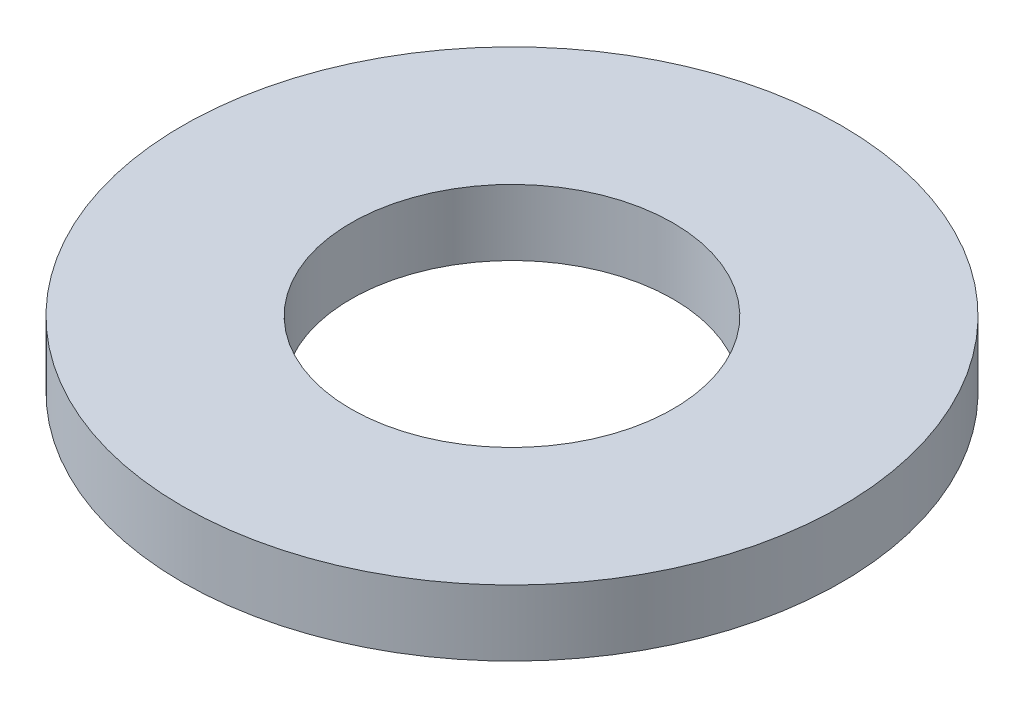
ISO-10303-21;
HEADER;
FILE_DESCRIPTION(('STEP AP214'),'2;1');
FILE_NAME('part.step','',(''),(''),'','','');
FILE_SCHEMA(('AUTOMOTIVE_DESIGN { 1 0 10303 214 1 1 1 1 }'));
ENDSEC;
DATA;
#1=APPLICATION_CONTEXT('core data for automotive mechanical design processes');
#2=APPLICATION_PROTOCOL_DEFINITION('international standard','automotive_design',2000,#1);
#3=PRODUCT_CONTEXT('',#1,'mechanical');
#4=PRODUCT('Part','Part','',(#3));
#5=PRODUCT_RELATED_PRODUCT_CATEGORY('part','',(#4));
#6=PRODUCT_DEFINITION_FORMATION('','',#4);
#7=PRODUCT_DEFINITION_CONTEXT('part definition',#1,'design');
#8=PRODUCT_DEFINITION('design','',#6,#7);
#9=PRODUCT_DEFINITION_SHAPE('','',#8);
#10=(LENGTH_UNIT() NAMED_UNIT(*) SI_UNIT(.MILLI.,.METRE.));
#11=(NAMED_UNIT(*) PLANE_ANGLE_UNIT() SI_UNIT($,.RADIAN.));
#12=(NAMED_UNIT(*) SI_UNIT($,.STERADIAN.) SOLID_ANGLE_UNIT());
#13=UNCERTAINTY_MEASURE_WITH_UNIT(LENGTH_MEASURE(1.E-05),#10,'distance_accuracy_value','');
#14=(GEOMETRIC_REPRESENTATION_CONTEXT(3) GLOBAL_UNCERTAINTY_ASSIGNED_CONTEXT((#13)) GLOBAL_UNIT_ASSIGNED_CONTEXT((#10,
#11,#12)) REPRESENTATION_CONTEXT('',''));
#15=CARTESIAN_POINT('',(0.,0.,0.));
#16=DIRECTION('',(0.,0.,1.));
#17=DIRECTION('',(1.,0.,0.));
#18=AXIS2_PLACEMENT_3D('',#15,#16,#17);
#19=CARTESIAN_POINT('',(0.,0.9,0.));
#20=DIRECTION('',(0.,1.,0.));
#21=DIRECTION('',(0.,0.,1.));
#22=AXIS2_PLACEMENT_3D('',#19,#20,#21);
#23=PLANE('',#22);
#24=CARTESIAN_POINT('',(0.,0.9,0.));
#25=DIRECTION('',(0.,1.,0.));
#26=DIRECTION('',(0.,0.,1.));
#27=AXIS2_PLACEMENT_3D('',#24,#25,#26);
#28=CIRCLE('',#27,4.5);
#29=CARTESIAN_POINT('',(0.,0.9,4.5));
#30=VERTEX_POINT('',#29);
#31=EDGE_CURVE('E10',#30,#30,#28,.T.);
#32=ORIENTED_EDGE('',*,*,#31,.T.);
#33=EDGE_LOOP('',(#32));
#34=FACE_BOUND('',#33,.T.);
#35=CARTESIAN_POINT('',(0.,0.9,0.));
#36=DIRECTION('',(0.,1.,0.));
#37=DIRECTION('',(0.,0.,1.));
#38=AXIS2_PLACEMENT_3D('',#35,#36,#37);
#39=CIRCLE('',#38,2.2);
#40=CARTESIAN_POINT('',(0.,0.9,2.2));
#41=VERTEX_POINT('',#40);
#42=EDGE_CURVE('E50',#41,#41,#39,.T.);
#43=ORIENTED_EDGE('',*,*,#42,.F.);
#44=EDGE_LOOP('',(#43));
#45=FACE_BOUND('',#44,.T.);
#46=ADVANCED_FACE('F37',(#34,#45),#23,.T.);
#47=CARTESIAN_POINT('',(0.,0.,0.));
#48=DIRECTION('',(0.,1.,0.));
#49=DIRECTION('',(0.,0.,1.));
#50=AXIS2_PLACEMENT_3D('',#47,#48,#49);
#51=PLANE('',#50);
#52=CARTESIAN_POINT('',(0.,0.,0.));
#53=DIRECTION('',(0.,1.,0.));
#54=DIRECTION('',(0.,0.,1.));
#55=AXIS2_PLACEMENT_3D('',#52,#53,#54);
#56=CIRCLE('',#55,4.5);
#57=CARTESIAN_POINT('',(0.,0.,4.5));
#58=VERTEX_POINT('',#57);
#59=EDGE_CURVE('E41',#58,#58,#56,.T.);
#60=ORIENTED_EDGE('',*,*,#59,.F.);
#61=EDGE_LOOP('',(#60));
#62=FACE_BOUND('',#61,.T.);
#63=CARTESIAN_POINT('',(0.,0.,0.));
#64=DIRECTION('',(0.,1.,0.));
#65=DIRECTION('',(0.,0.,1.));
#66=AXIS2_PLACEMENT_3D('',#63,#64,#65);
#67=CIRCLE('',#66,2.2);
#68=CARTESIAN_POINT('',(0.,0.,2.2));
#69=VERTEX_POINT('',#68);
#70=EDGE_CURVE('E52',#69,#69,#67,.T.);
#71=ORIENTED_EDGE('',*,*,#70,.T.);
#72=EDGE_LOOP('',(#71));
#73=FACE_BOUND('',#72,.T.);
#74=ADVANCED_FACE('F64',(#62,#73),#51,.F.);
#75=CARTESIAN_POINT('',(0.,0.9,0.));
#76=DIRECTION('',(0.,-1.,0.));
#77=DIRECTION('',(0.,0.,-1.));
#78=AXIS2_PLACEMENT_3D('',#75,#76,#77);
#79=CYLINDRICAL_SURFACE('',#78,4.5);
#80=ORIENTED_EDGE('',*,*,#31,.F.);
#81=EDGE_LOOP('',(#80));
#82=FACE_BOUND('',#81,.T.);
#83=ORIENTED_EDGE('',*,*,#59,.T.);
#84=EDGE_LOOP('',(#83));
#85=FACE_BOUND('',#84,.T.);
#86=ADVANCED_FACE('F39',(#82,#85),#79,.T.);
#87=CARTESIAN_POINT('',(0.,0.9,0.));
#88=DIRECTION('',(0.,-1.,0.));
#89=DIRECTION('',(0.,0.,-1.));
#90=AXIS2_PLACEMENT_3D('',#87,#88,#89);
#91=CYLINDRICAL_SURFACE('',#90,2.2);
#92=ORIENTED_EDGE('',*,*,#42,.T.);
#93=EDGE_LOOP('',(#92));
#94=FACE_BOUND('',#93,.T.);
#95=ORIENTED_EDGE('',*,*,#70,.F.);
#96=EDGE_LOOP('',(#95));
#97=FACE_BOUND('',#96,.T.);
#98=ADVANCED_FACE('F60',(#94,#97),#91,.F.);
#99=CLOSED_SHELL('',(#46,#74,#86,#98));
#100=MANIFOLD_SOLID_BREP('B2',#99);
#101=ADVANCED_BREP_SHAPE_REPRESENTATION('',(#18,#100),#14);
#102=SHAPE_DEFINITION_REPRESENTATION(#9,#101);
ENDSEC;
END-ISO-10303-21;
